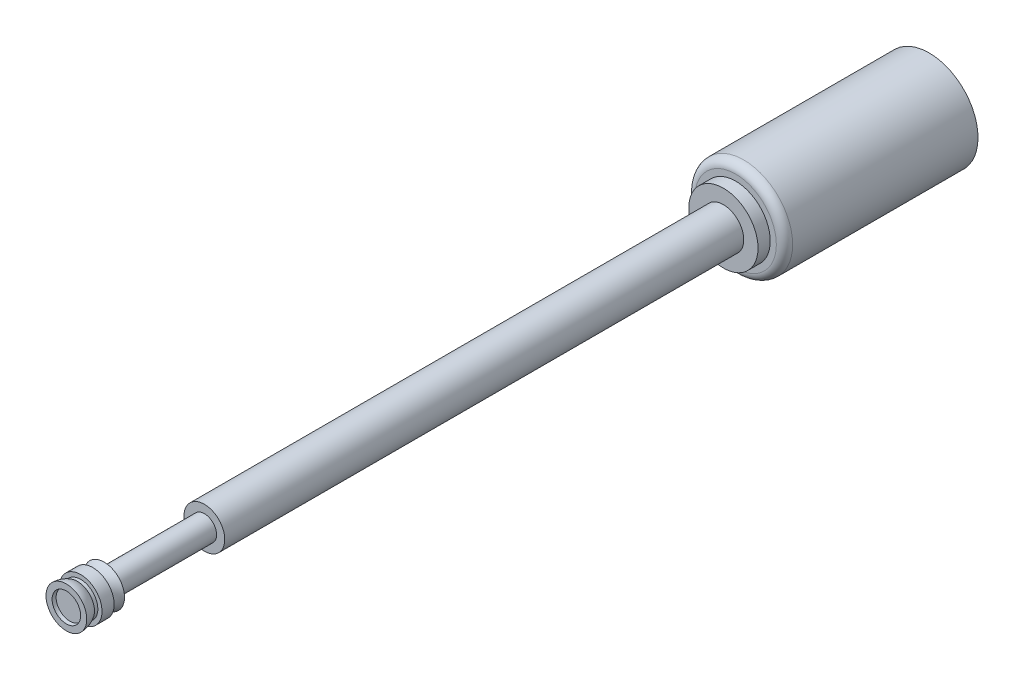
ISO-10303-21;
HEADER;
FILE_DESCRIPTION(('STEP AP214'),'2;1');
FILE_NAME('part.step','',(''),(''),'','','');
FILE_SCHEMA(('AUTOMOTIVE_DESIGN { 1 0 10303 214 1 1 1 1 }'));
ENDSEC;
DATA;
#1=APPLICATION_CONTEXT('core data for automotive mechanical design processes');
#2=APPLICATION_PROTOCOL_DEFINITION('international standard','automotive_design',2000,#1);
#3=PRODUCT_CONTEXT('',#1,'mechanical');
#4=PRODUCT('Part','Part','',(#3));
#5=PRODUCT_RELATED_PRODUCT_CATEGORY('part','',(#4));
#6=PRODUCT_DEFINITION_FORMATION('','',#4);
#7=PRODUCT_DEFINITION_CONTEXT('part definition',#1,'design');
#8=PRODUCT_DEFINITION('design','',#6,#7);
#9=PRODUCT_DEFINITION_SHAPE('','',#8);
#10=(LENGTH_UNIT() NAMED_UNIT(*) SI_UNIT(.MILLI.,.METRE.));
#11=(NAMED_UNIT(*) PLANE_ANGLE_UNIT() SI_UNIT($,.RADIAN.));
#12=(NAMED_UNIT(*) SI_UNIT($,.STERADIAN.) SOLID_ANGLE_UNIT());
#13=UNCERTAINTY_MEASURE_WITH_UNIT(LENGTH_MEASURE(1.E-05),#10,'distance_accuracy_value','');
#14=(GEOMETRIC_REPRESENTATION_CONTEXT(3) GLOBAL_UNCERTAINTY_ASSIGNED_CONTEXT((#13)) GLOBAL_UNIT_ASSIGNED_CONTEXT((#10,
#11,#12)) REPRESENTATION_CONTEXT('',''));
#15=CARTESIAN_POINT('',(0.,0.,0.));
#16=DIRECTION('',(0.,0.,1.));
#17=DIRECTION('',(1.,0.,0.));
#18=AXIS2_PLACEMENT_3D('',#15,#16,#17);
#19=CARTESIAN_POINT('',(0.,0.,16.4275));
#20=DIRECTION('',(0.,0.,-1.));
#21=DIRECTION('',(1.,0.,0.));
#22=AXIS2_PLACEMENT_3D('',#19,#20,#21);
#23=SPHERICAL_SURFACE('',#22,0.35);
#24=CARTESIAN_POINT('',(0.,0.,16.34));
#25=DIRECTION('',(0.,0.,1.));
#26=DIRECTION('',(1.,0.,0.));
#27=AXIS2_PLACEMENT_3D('',#24,#25,#26);
#28=CIRCLE('',#27,0.338886042793149);
#29=CARTESIAN_POINT('',(0.338886042793149,0.,16.34));
#30=VERTEX_POINT('',#29);
#31=EDGE_CURVE('E62',#30,#30,#28,.F.);
#32=ORIENTED_EDGE('',*,*,#31,.T.);
#33=EDGE_LOOP('',(#32));
#34=FACE_BOUND('',#33,.T.);
#35=CARTESIAN_POINT('',(0.,0.,16.4275));
#36=DIRECTION('',(0.,0.,-1.));
#37=DIRECTION('',(-1.,0.,0.));
#38=AXIS2_PLACEMENT_3D('',#35,#36,#37);
#39=CIRCLE('',#38,0.35);
#40=CARTESIAN_POINT('',(-0.35,0.,16.4275));
#41=VERTEX_POINT('',#40);
#42=EDGE_CURVE('E64',#41,#41,#39,.T.);
#43=ORIENTED_EDGE('',*,*,#42,.F.);
#44=EDGE_LOOP('',(#43));
#45=FACE_BOUND('',#44,.T.);
#46=ADVANCED_FACE('F38',(#34,#45),#23,.F.);
#47=CARTESIAN_POINT('',(0.,0.,15.7784109380333));
#48=DIRECTION('',(0.,0.,-1.));
#49=DIRECTION('',(-1.,0.,0.));
#50=AXIS2_PLACEMENT_3D('',#47,#48,#49);
#51=TOROIDAL_SURFACE('',#50,0.953769853605557,0.5323717972036);
#52=CARTESIAN_POINT('',(0.,0.,15.5));
#53=DIRECTION('',(0.,0.,-1.));
#54=DIRECTION('',(-1.,0.,0.));
#55=AXIS2_PLACEMENT_3D('',#52,#53,#54);
#56=CIRCLE('',#55,0.499999999999999);
#57=CARTESIAN_POINT('',(-0.499999999999999,0.,15.5));
#58=VERTEX_POINT('',#57);
#59=EDGE_CURVE('E76',#58,#58,#56,.F.);
#60=ORIENTED_EDGE('',*,*,#59,.T.);
#61=EDGE_LOOP('',(#60));
#62=FACE_BOUND('',#61,.T.);
#63=CARTESIAN_POINT('',(0.,0.,15.7784109380333));
#64=DIRECTION('',(0.,0.,-1.));
#65=DIRECTION('',(-1.,0.,0.));
#66=AXIS2_PLACEMENT_3D('',#63,#64,#65);
#67=CIRCLE('',#66,0.421398056401956);
#68=CARTESIAN_POINT('',(-0.421398056401956,0.,15.7784109380333));
#69=VERTEX_POINT('',#68);
#70=EDGE_CURVE('E90',#69,#69,#67,.T.);
#71=ORIENTED_EDGE('',*,*,#70,.T.);
#72=EDGE_LOOP('',(#71));
#73=FACE_BOUND('',#72,.T.);
#74=ADVANCED_FACE('F117',(#62,#73),#51,.F.);
#75=CARTESIAN_POINT('',(0.52384522244463,0.,15.7784109380333));
#76=DIRECTION('',(0.,0.,1.));
#77=DIRECTION('',(1.,0.,0.));
#78=AXIS2_PLACEMENT_3D('',#75,#76,#77);
#79=PLANE('',#78);
#80=ORIENTED_EDGE('',*,*,#70,.F.);
#81=EDGE_LOOP('',(#80));
#82=FACE_BOUND('',#81,.T.);
#83=CARTESIAN_POINT('',(0.,0.,15.7784109380333));
#84=DIRECTION('',(0.,0.,-1.));
#85=DIRECTION('',(-1.,0.,0.));
#86=AXIS2_PLACEMENT_3D('',#83,#84,#85);
#87=CIRCLE('',#86,0.52384522244463);
#88=CARTESIAN_POINT('',(-0.52384522244463,0.,15.7784109380333));
#89=VERTEX_POINT('',#88);
#90=EDGE_CURVE('E87',#89,#89,#87,.T.);
#91=ORIENTED_EDGE('',*,*,#90,.T.);
#92=EDGE_LOOP('',(#91));
#93=FACE_BOUND('',#92,.T.);
#94=ADVANCED_FACE('F123',(#82,#93),#79,.F.);
#95=CARTESIAN_POINT('',(0.,0.,15.5));
#96=DIRECTION('',(0.,0.,-1.));
#97=DIRECTION('',(-1.,0.,0.));
#98=AXIS2_PLACEMENT_3D('',#95,#96,#97);
#99=CYLINDRICAL_SURFACE('',#98,0.52384522244463);
#100=ORIENTED_EDGE('',*,*,#90,.F.);
#101=EDGE_LOOP('',(#100));
#102=FACE_BOUND('',#101,.T.);
#103=CARTESIAN_POINT('',(0.,0.,16.0764390574302));
#104=DIRECTION('',(0.,0.,-1.));
#105=DIRECTION('',(-1.,0.,0.));
#106=AXIS2_PLACEMENT_3D('',#103,#104,#105);
#107=CIRCLE('',#106,0.52384522244463);
#108=CARTESIAN_POINT('',(-0.52384522244463,0.,16.0764390574302));
#109=VERTEX_POINT('',#108);
#110=EDGE_CURVE('E84',#109,#109,#107,.T.);
#111=ORIENTED_EDGE('',*,*,#110,.T.);
#112=EDGE_LOOP('',(#111));
#113=FACE_BOUND('',#112,.T.);
#114=ADVANCED_FACE('F169',(#102,#113),#99,.T.);
#115=CARTESIAN_POINT('',(0.421398056401956,0.,16.0764390574302));
#116=DIRECTION('',(0.,0.,-1.));
#117=DIRECTION('',(-1.,0.,0.));
#118=AXIS2_PLACEMENT_3D('',#115,#116,#117);
#119=PLANE('',#118);
#120=ORIENTED_EDGE('',*,*,#110,.F.);
#121=EDGE_LOOP('',(#120));
#122=FACE_BOUND('',#121,.T.);
#123=CARTESIAN_POINT('',(0.,0.,16.0764390574302));
#124=DIRECTION('',(0.,0.,-1.));
#125=DIRECTION('',(-1.,0.,0.));
#126=AXIS2_PLACEMENT_3D('',#123,#124,#125);
#127=CIRCLE('',#126,0.421398056401956);
#128=CARTESIAN_POINT('',(-0.421398056401956,0.,16.0764390574302));
#129=VERTEX_POINT('',#128);
#130=EDGE_CURVE('E81',#129,#129,#127,.T.);
#131=ORIENTED_EDGE('',*,*,#130,.T.);
#132=EDGE_LOOP('',(#131));
#133=FACE_BOUND('',#132,.T.);
#134=ADVANCED_FACE('F165',(#122,#133),#119,.F.);
#135=CARTESIAN_POINT('',(0.,0.,15.5));
#136=DIRECTION('',(0.,0.,-1.));
#137=DIRECTION('',(-1.,0.,0.));
#138=AXIS2_PLACEMENT_3D('',#135,#136,#137);
#139=CYLINDRICAL_SURFACE('',#138,0.421398056401956);
#140=ORIENTED_EDGE('',*,*,#130,.F.);
#141=EDGE_LOOP('',(#140));
#142=FACE_BOUND('',#141,.T.);
#143=CARTESIAN_POINT('',(0.,0.,16.1583835232457));
#144=DIRECTION('',(0.,0.,-1.));
#145=DIRECTION('',(-1.,0.,0.));
#146=AXIS2_PLACEMENT_3D('',#143,#144,#145);
#147=CIRCLE('',#146,0.421398056401956);
#148=CARTESIAN_POINT('',(-0.421398056401956,0.,16.1583835232457));
#149=VERTEX_POINT('',#148);
#150=EDGE_CURVE('E73',#149,#149,#147,.T.);
#151=ORIENTED_EDGE('',*,*,#150,.T.);
#152=EDGE_LOOP('',(#151));
#153=FACE_BOUND('',#152,.T.);
#154=ADVANCED_FACE('F158',(#142,#153),#139,.T.);
#155=CARTESIAN_POINT('',(0.,0.,16.4275));
#156=DIRECTION('',(0.,0.,-1.));
#157=DIRECTION('',(1.,0.,0.));
#158=AXIS2_PLACEMENT_3D('',#155,#156,#157);
#159=SPHERICAL_SURFACE('',#158,0.5);
#160=ORIENTED_EDGE('',*,*,#150,.F.);
#161=EDGE_LOOP('',(#160));
#162=FACE_BOUND('',#161,.T.);
#163=CARTESIAN_POINT('',(0.,0.,16.4275));
#164=DIRECTION('',(0.,0.,-1.));
#165=DIRECTION('',(-1.,0.,0.));
#166=AXIS2_PLACEMENT_3D('',#163,#164,#165);
#167=CIRCLE('',#166,0.5);
#168=CARTESIAN_POINT('',(-0.5,0.,16.4275));
#169=VERTEX_POINT('',#168);
#170=EDGE_CURVE('E68',#169,#169,#167,.T.);
#171=ORIENTED_EDGE('',*,*,#170,.T.);
#172=EDGE_LOOP('',(#171));
#173=FACE_BOUND('',#172,.T.);
#174=ADVANCED_FACE('F153',(#162,#173),#159,.T.);
#175=CARTESIAN_POINT('',(0.35,0.,16.4275));
#176=DIRECTION('',(0.,0.,-1.));
#177=DIRECTION('',(-1.,0.,0.));
#178=AXIS2_PLACEMENT_3D('',#175,#176,#177);
#179=PLANE('',#178);
#180=ORIENTED_EDGE('',*,*,#170,.F.);
#181=EDGE_LOOP('',(#180));
#182=FACE_BOUND('',#181,.T.);
#183=ORIENTED_EDGE('',*,*,#42,.T.);
#184=EDGE_LOOP('',(#183));
#185=FACE_BOUND('',#184,.T.);
#186=ADVANCED_FACE('F146',(#182,#185),#179,.F.);
#187=CARTESIAN_POINT('',(0.,0.,16.34));
#188=DIRECTION('',(0.,0.,1.));
#189=DIRECTION('',(1.,0.,0.));
#190=AXIS2_PLACEMENT_3D('',#187,#188,#189);
#191=PLANE('',#190);
#192=ORIENTED_EDGE('',*,*,#31,.F.);
#193=EDGE_LOOP('',(#192));
#194=FACE_BOUND('',#193,.T.);
#195=ADVANCED_FACE('F143',(#194),#191,.T.);
#196=CARTESIAN_POINT('',(-0.3,0.,13.04));
#197=DIRECTION('',(0.,0.,-1.));
#198=DIRECTION('',(-1.,0.,0.));
#199=AXIS2_PLACEMENT_3D('',#196,#197,#198);
#200=PLANE('',#199);
#201=CARTESIAN_POINT('',(0.,0.,13.04));
#202=DIRECTION('',(0.,0.,-1.));
#203=DIRECTION('',(-1.,0.,0.));
#204=AXIS2_PLACEMENT_3D('',#201,#202,#203);
#205=CIRCLE('',#204,0.3);
#206=CARTESIAN_POINT('',(-0.3,0.,13.04));
#207=VERTEX_POINT('',#206);
#208=EDGE_CURVE('E318',#207,#207,#205,.T.);
#209=ORIENTED_EDGE('',*,*,#208,.T.);
#210=EDGE_LOOP('',(#209));
#211=FACE_BOUND('',#210,.T.);
#212=CARTESIAN_POINT('',(0.,0.,13.04));
#213=DIRECTION('',(0.,0.,-1.));
#214=DIRECTION('',(-1.,0.,0.));
#215=AXIS2_PLACEMENT_3D('',#212,#213,#214);
#216=CIRCLE('',#215,0.5);
#217=CARTESIAN_POINT('',(-0.5,0.,13.04));
#218=VERTEX_POINT('',#217);
#219=EDGE_CURVE('E42',#218,#218,#216,.T.);
#220=ORIENTED_EDGE('',*,*,#219,.F.);
#221=EDGE_LOOP('',(#220));
#222=FACE_BOUND('',#221,.T.);
#223=ADVANCED_FACE('F145',(#211,#222),#200,.F.);
#224=CARTESIAN_POINT('',(-0.3,0.,15.5));
#225=DIRECTION('',(0.,0.,1.));
#226=DIRECTION('',(1.,0.,0.));
#227=AXIS2_PLACEMENT_3D('',#224,#225,#226);
#228=PLANE('',#227);
#229=CARTESIAN_POINT('',(0.,0.,15.5));
#230=DIRECTION('',(0.,0.,-1.));
#231=DIRECTION('',(-1.,0.,0.));
#232=AXIS2_PLACEMENT_3D('',#229,#230,#231);
#233=CIRCLE('',#232,0.3);
#234=CARTESIAN_POINT('',(-0.3,0.,15.5));
#235=VERTEX_POINT('',#234);
#236=EDGE_CURVE('E321',#235,#235,#233,.T.);
#237=ORIENTED_EDGE('',*,*,#236,.F.);
#238=EDGE_LOOP('',(#237));
#239=FACE_BOUND('',#238,.T.);
#240=ORIENTED_EDGE('',*,*,#59,.F.);
#241=EDGE_LOOP('',(#240));
#242=FACE_BOUND('',#241,.T.);
#243=ADVANCED_FACE('F111',(#239,#242),#228,.F.);
#244=CARTESIAN_POINT('',(0.,0.,15.5));
#245=DIRECTION('',(0.,0.,-1.));
#246=DIRECTION('',(-1.,0.,0.));
#247=AXIS2_PLACEMENT_3D('',#244,#245,#246);
#248=CYLINDRICAL_SURFACE('',#247,0.3);
#249=ORIENTED_EDGE('',*,*,#208,.F.);
#250=EDGE_LOOP('',(#249));
#251=FACE_BOUND('',#250,.T.);
#252=ORIENTED_EDGE('',*,*,#236,.T.);
#253=EDGE_LOOP('',(#252));
#254=FACE_BOUND('',#253,.T.);
#255=ADVANCED_FACE('F104',(#251,#254),#248,.T.);
#256=CARTESIAN_POINT('',(0.,0.,-4.75));
#257=DIRECTION('',(0.,0.,1.));
#258=DIRECTION('',(1.,0.,0.));
#259=AXIS2_PLACEMENT_3D('',#256,#257,#258);
#260=PLANE('',#259);
#261=CARTESIAN_POINT('',(0.,0.,-4.75));
#262=DIRECTION('',(0.,0.,1.));
#263=DIRECTION('',(1.,0.,0.));
#264=AXIS2_PLACEMENT_3D('',#261,#262,#263);
#265=CIRCLE('',#264,1.2);
#266=CARTESIAN_POINT('',(1.2,0.,-4.75));
#267=VERTEX_POINT('',#266);
#268=EDGE_CURVE('E52',#267,#267,#265,.T.);
#269=ORIENTED_EDGE('',*,*,#268,.F.);
#270=EDGE_LOOP('',(#269));
#271=FACE_BOUND('',#270,.T.);
#272=ADVANCED_FACE('F102',(#271),#260,.F.);
#273=CARTESIAN_POINT('',(0.,0.,-4.75));
#274=DIRECTION('',(0.,0.,1.));
#275=DIRECTION('',(1.,0.,0.));
#276=AXIS2_PLACEMENT_3D('',#273,#274,#275);
#277=CYLINDRICAL_SURFACE('',#276,1.2);
#278=CARTESIAN_POINT('',(0.,0.,-0.2));
#279=DIRECTION('',(0.,0.,1.));
#280=DIRECTION('',(1.,0.,0.));
#281=AXIS2_PLACEMENT_3D('',#278,#279,#280);
#282=CIRCLE('',#281,1.2);
#283=CARTESIAN_POINT('',(1.2,0.,-0.2));
#284=VERTEX_POINT('',#283);
#285=EDGE_CURVE('E10',#284,#284,#282,.F.);
#286=ORIENTED_EDGE('',*,*,#285,.T.);
#287=EDGE_LOOP('',(#286));
#288=FACE_BOUND('',#287,.T.);
#289=ORIENTED_EDGE('',*,*,#268,.T.);
#290=EDGE_LOOP('',(#289));
#291=FACE_BOUND('',#290,.T.);
#292=ADVANCED_FACE('F100',(#288,#291),#277,.T.);
#293=CARTESIAN_POINT('',(0.,0.,-0.2));
#294=DIRECTION('',(0.,0.,1.));
#295=DIRECTION('',(1.,0.,0.));
#296=AXIS2_PLACEMENT_3D('',#293,#294,#295);
#297=TOROIDAL_SURFACE('',#296,1.,0.2);
#298=ORIENTED_EDGE('',*,*,#285,.F.);
#299=EDGE_LOOP('',(#298));
#300=FACE_BOUND('',#299,.T.);
#301=CARTESIAN_POINT('',(0.,0.,0.));
#302=DIRECTION('',(0.,0.,1.));
#303=DIRECTION('',(1.,0.,0.));
#304=AXIS2_PLACEMENT_3D('',#301,#302,#303);
#305=CIRCLE('',#304,1.);
#306=CARTESIAN_POINT('',(1.,0.,0.));
#307=VERTEX_POINT('',#306);
#308=EDGE_CURVE('E47',#307,#307,#305,.T.);
#309=ORIENTED_EDGE('',*,*,#308,.F.);
#310=EDGE_LOOP('',(#309));
#311=FACE_BOUND('',#310,.T.);
#312=ADVANCED_FACE('F40',(#300,#311),#297,.T.);
#313=CARTESIAN_POINT('',(0.,0.,0.));
#314=DIRECTION('',(0.,0.,1.));
#315=DIRECTION('',(1.,0.,0.));
#316=AXIS2_PLACEMENT_3D('',#313,#314,#315);
#317=PLANE('',#316);
#318=CARTESIAN_POINT('',(0.,0.,0.));
#319=DIRECTION('',(0.,0.,1.));
#320=DIRECTION('',(1.,0.,0.));
#321=AXIS2_PLACEMENT_3D('',#318,#319,#320);
#322=CIRCLE('',#321,0.85);
#323=CARTESIAN_POINT('',(0.85,0.,0.));
#324=VERTEX_POINT('',#323);
#325=EDGE_CURVE('E93',#324,#324,#322,.T.);
#326=ORIENTED_EDGE('',*,*,#325,.F.);
#327=EDGE_LOOP('',(#326));
#328=FACE_BOUND('',#327,.T.);
#329=ORIENTED_EDGE('',*,*,#308,.T.);
#330=EDGE_LOOP('',(#329));
#331=FACE_BOUND('',#330,.T.);
#332=ADVANCED_FACE('F183',(#328,#331),#317,.T.);
#333=CARTESIAN_POINT('',(0.,0.,0.3));
#334=DIRECTION('',(0.,0.,-1.));
#335=DIRECTION('',(-1.,0.,0.));
#336=AXIS2_PLACEMENT_3D('',#333,#334,#335);
#337=CYLINDRICAL_SURFACE('',#336,0.85);
#338=CARTESIAN_POINT('',(0.,0.,0.3));
#339=DIRECTION('',(0.,0.,1.));
#340=DIRECTION('',(1.,0.,0.));
#341=AXIS2_PLACEMENT_3D('',#338,#339,#340);
#342=CIRCLE('',#341,0.85);
#343=CARTESIAN_POINT('',(0.85,0.,0.3));
#344=VERTEX_POINT('',#343);
#345=EDGE_CURVE('E59',#344,#344,#342,.T.);
#346=ORIENTED_EDGE('',*,*,#345,.F.);
#347=EDGE_LOOP('',(#346));
#348=FACE_BOUND('',#347,.T.);
#349=ORIENTED_EDGE('',*,*,#325,.T.);
#350=EDGE_LOOP('',(#349));
#351=FACE_BOUND('',#350,.T.);
#352=ADVANCED_FACE('F180',(#348,#351),#337,.T.);
#353=CARTESIAN_POINT('',(0.,0.,0.3));
#354=DIRECTION('',(0.,0.,1.));
#355=DIRECTION('',(1.,0.,0.));
#356=AXIS2_PLACEMENT_3D('',#353,#354,#355);
#357=PLANE('',#356);
#358=CARTESIAN_POINT('',(0.,0.,0.3));
#359=DIRECTION('',(0.,0.,1.));
#360=DIRECTION('',(1.,0.,0.));
#361=AXIS2_PLACEMENT_3D('',#358,#359,#360);
#362=CIRCLE('',#361,0.5);
#363=CARTESIAN_POINT('',(0.5,0.,0.3));
#364=VERTEX_POINT('',#363);
#365=EDGE_CURVE('E56',#364,#364,#362,.T.);
#366=ORIENTED_EDGE('',*,*,#365,.F.);
#367=EDGE_LOOP('',(#366));
#368=FACE_BOUND('',#367,.T.);
#369=ORIENTED_EDGE('',*,*,#345,.T.);
#370=EDGE_LOOP('',(#369));
#371=FACE_BOUND('',#370,.T.);
#372=ADVANCED_FACE('F177',(#368,#371),#357,.T.);
#373=CARTESIAN_POINT('',(0.,0.,15.5));
#374=DIRECTION('',(0.,0.,-1.));
#375=DIRECTION('',(-1.,0.,0.));
#376=AXIS2_PLACEMENT_3D('',#373,#374,#375);
#377=CYLINDRICAL_SURFACE('',#376,0.5);
#378=ORIENTED_EDGE('',*,*,#219,.T.);
#379=EDGE_LOOP('',(#378));
#380=FACE_BOUND('',#379,.T.);
#381=ORIENTED_EDGE('',*,*,#365,.T.);
#382=EDGE_LOOP('',(#381));
#383=FACE_BOUND('',#382,.T.);
#384=ADVANCED_FACE('F179',(#380,#383),#377,.T.);
#385=CLOSED_SHELL('',(#46,#74,#94,#114,#134,#154,#174,#186,#195,#223,#243,#255,#272,#292,#312,
#332,#352,#372,#384));
#386=CARTESIAN_POINT('',(0.,0.,16.310726677136));
#387=DIRECTION('',(0.,0.,-1.));
#388=DIRECTION('',(-1.,0.,0.));
#389=AXIS2_PLACEMENT_3D('',#386,#387,#388);
#390=CIRCLE('',#389,0.329945436500201);
#391=CARTESIAN_POINT('',(-0.329945436500201,0.,16.310726677136));
#392=VERTEX_POINT('',#391);
#393=EDGE_CURVE('E60',#392,#392,#390,.F.);
#394=ORIENTED_EDGE('',*,*,#393,.T.);
#395=EDGE_LOOP('',(#394));
#396=FACE_BOUND('',#395,.T.);
#397=ADVANCED_FACE('F119',(#396),#23,.F.);
#398=CARTESIAN_POINT('',(0.,0.,16.310726677136));
#399=DIRECTION('',(0.,0.,-1.));
#400=DIRECTION('',(-1.,0.,0.));
#401=AXIS2_PLACEMENT_3D('',#398,#399,#400);
#402=PLANE('',#401);
#403=ORIENTED_EDGE('',*,*,#393,.F.);
#404=EDGE_LOOP('',(#403));
#405=FACE_BOUND('',#404,.T.);
#406=ADVANCED_FACE('F130',(#405),#402,.T.);
#407=CLOSED_SHELL('',(#397,#406));
#408=ORIENTED_CLOSED_SHELL('',*,#407,.T.);
#409=BREP_WITH_VOIDS('B2',#385,(#408));
#410=ADVANCED_BREP_SHAPE_REPRESENTATION('',(#18,#409),#14);
#411=SHAPE_DEFINITION_REPRESENTATION(#9,#410);
ENDSEC;
END-ISO-10303-21;
